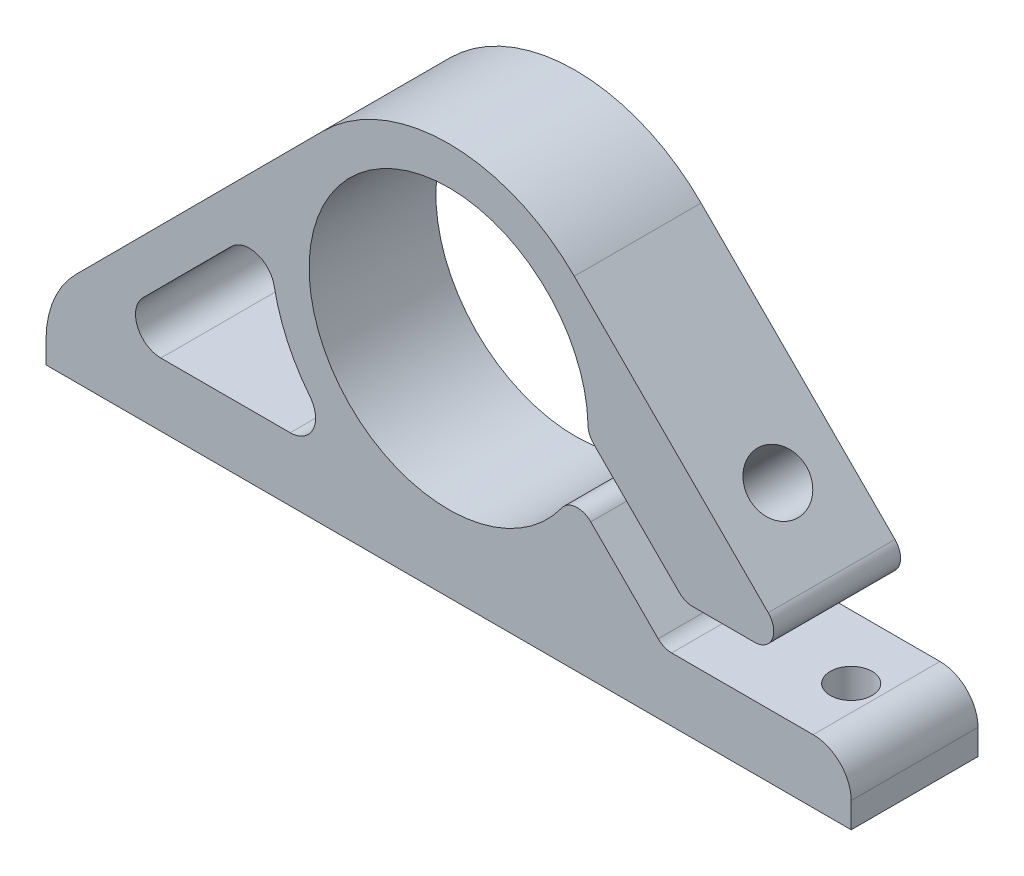
ISO-10303-21;
HEADER;
FILE_DESCRIPTION(('STEP AP214'),'2;1');
FILE_NAME('part.step','',(''),(''),'','','');
FILE_SCHEMA(('AUTOMOTIVE_DESIGN { 1 0 10303 214 1 1 1 1 }'));
ENDSEC;
DATA;
#1=APPLICATION_CONTEXT('core data for automotive mechanical design processes');
#2=APPLICATION_PROTOCOL_DEFINITION('international standard','automotive_design',2000,#1);
#3=PRODUCT_CONTEXT('',#1,'mechanical');
#4=PRODUCT('Part','Part','',(#3));
#5=PRODUCT_RELATED_PRODUCT_CATEGORY('part','',(#4));
#6=PRODUCT_DEFINITION_FORMATION('','',#4);
#7=PRODUCT_DEFINITION_CONTEXT('part definition',#1,'design');
#8=PRODUCT_DEFINITION('design','',#6,#7);
#9=PRODUCT_DEFINITION_SHAPE('','',#8);
#10=(LENGTH_UNIT() NAMED_UNIT(*) SI_UNIT(.MILLI.,.METRE.));
#11=(NAMED_UNIT(*) PLANE_ANGLE_UNIT() SI_UNIT($,.RADIAN.));
#12=(NAMED_UNIT(*) SI_UNIT($,.STERADIAN.) SOLID_ANGLE_UNIT());
#13=UNCERTAINTY_MEASURE_WITH_UNIT(LENGTH_MEASURE(1.E-05),#10,'distance_accuracy_value','');
#14=(GEOMETRIC_REPRESENTATION_CONTEXT(3) GLOBAL_UNCERTAINTY_ASSIGNED_CONTEXT((#13)) GLOBAL_UNIT_ASSIGNED_CONTEXT((#10,
#11,#12)) REPRESENTATION_CONTEXT('',''));
#15=CARTESIAN_POINT('',(0.,0.,0.));
#16=DIRECTION('',(0.,0.,1.));
#17=DIRECTION('',(1.,0.,0.));
#18=AXIS2_PLACEMENT_3D('',#15,#16,#17);
#19=CARTESIAN_POINT('',(0.,0.,10.));
#20=DIRECTION('',(0.,0.,1.));
#21=DIRECTION('',(1.,0.,0.));
#22=AXIS2_PLACEMENT_3D('',#19,#20,#21);
#23=PLANE('',#22);
#24=CARTESIAN_POINT('',(0.,0.,10.));
#25=DIRECTION('',(0.,0.,-1.));
#26=DIRECTION('',(1.,0.,0.));
#27=AXIS2_PLACEMENT_3D('',#24,#25,#26);
#28=CIRCLE('',#27,14.);
#29=CARTESIAN_POINT('',(-10.9287464971972,-8.75,10.));
#30=VERTEX_POINT('',#29);
#31=CARTESIAN_POINT('',(-13.7504022944796,-2.63181244391958,10.));
#32=VERTEX_POINT('',#31);
#33=EDGE_CURVE('E233',#30,#32,#28,.T.);
#34=ORIENTED_EDGE('',*,*,#33,.F.);
#35=CARTESIAN_POINT('',(-12.4899959967968,-10.,10.));
#36=DIRECTION('',(0.,0.,1.));
#37=DIRECTION('',(1.,0.,0.));
#38=AXIS2_PLACEMENT_3D('',#35,#36,#37);
#39=CIRCLE('',#38,2.);
#40=CARTESIAN_POINT('',(-12.4899959967968,-12.,10.));
#41=VERTEX_POINT('',#40);
#42=EDGE_CURVE('E396',#30,#41,#39,.F.);
#43=ORIENTED_EDGE('',*,*,#42,.T.);
#44=DIRECTION('',(1.,0.,0.));
#45=VECTOR('',#44,1.);
#46=CARTESIAN_POINT('',(-22.6913140604261,-12.,10.));
#47=LINE('',#46,#45);
#48=CARTESIAN_POINT('',(-22.6913140604261,-12.,10.));
#49=VERTEX_POINT('',#48);
#50=EDGE_CURVE('E239',#49,#41,#47,.T.);
#51=ORIENTED_EDGE('',*,*,#50,.F.);
#52=CARTESIAN_POINT('',(-22.6913140604261,-10.,10.));
#53=DIRECTION('',(0.,0.,1.));
#54=DIRECTION('',(1.,0.,0.));
#55=AXIS2_PLACEMENT_3D('',#52,#53,#54);
#56=CIRCLE('',#55,2.);
#57=CARTESIAN_POINT('',(-24.1071107280171,-8.58737131699868,10.));
#58=VERTEX_POINT('',#57);
#59=EDGE_CURVE('E210',#58,#49,#56,.T.);
#60=ORIENTED_EDGE('',*,*,#59,.F.);
#61=DIRECTION('',(-0.706314341500663,-0.707898333795528,0.));
#62=VECTOR('',#61,1.);
#63=CARTESIAN_POINT('',(-13.9037432997193,1.63887835287128,10.));
#64=LINE('',#63,#62);
#65=CARTESIAN_POINT('',(-17.1305421469963,-1.59515696719248,10.));
#66=VERTEX_POINT('',#65);
#67=EDGE_CURVE('E236',#66,#58,#64,.T.);
#68=ORIENTED_EDGE('',*,*,#67,.F.);
#69=CARTESIAN_POINT('',(-15.7147454794053,-3.00778565019381,10.));
#70=DIRECTION('',(0.,0.,1.));
#71=DIRECTION('',(1.,0.,0.));
#72=AXIS2_PLACEMENT_3D('',#69,#70,#71);
#73=CIRCLE('',#72,2.);
#74=EDGE_CURVE('E400',#66,#32,#73,.F.);
#75=ORIENTED_EDGE('',*,*,#74,.T.);
#76=EDGE_LOOP('',(#34,#43,#51,#60,#68,#75));
#77=FACE_BOUND('',#76,.T.);
#78=DIRECTION('',(-0.706314341500663,-0.707898333795528,0.));
#79=VECTOR('',#78,1.);
#80=CARTESIAN_POINT('',(-31.7499999999999,-12.,10.));
#81=LINE('',#80,#79);
#82=CARTESIAN_POINT('',(-9.9105766731374,9.88840078100929,10.));
#83=VERTEX_POINT('',#82);
#84=CARTESIAN_POINT('',(-29.4131866703642,-9.65794609390811,10.));
#85=VERTEX_POINT('',#84);
#86=EDGE_CURVE('E304',#83,#85,#81,.T.);
#87=ORIENTED_EDGE('',*,*,#86,.T.);
#88=CARTESIAN_POINT('',(-23.7499999999999,-15.3084608259134,10.));
#89=DIRECTION('',(0.,0.,1.));
#90=DIRECTION('',(1.,0.,0.));
#91=AXIS2_PLACEMENT_3D('',#88,#89,#90);
#92=CIRCLE('',#91,8.);
#93=CARTESIAN_POINT('',(-31.7499999999999,-15.3084608259134,10.));
#94=VERTEX_POINT('',#93);
#95=EDGE_CURVE('E11',#85,#94,#92,.T.);
#96=ORIENTED_EDGE('',*,*,#95,.T.);
#97=DIRECTION('',(0.,-1.,0.));
#98=VECTOR('',#97,1.);
#99=CARTESIAN_POINT('',(-31.7499999999999,-12.,10.));
#100=LINE('',#99,#98);
#101=CARTESIAN_POINT('',(-31.7499999999999,-17.,10.));
#102=VERTEX_POINT('',#101);
#103=EDGE_CURVE('E306',#94,#102,#100,.T.);
#104=ORIENTED_EDGE('',*,*,#103,.T.);
#105=DIRECTION('',(1.,0.,0.));
#106=VECTOR('',#105,1.);
#107=CARTESIAN_POINT('',(-31.7499999999999,-17.,10.));
#108=LINE('',#107,#106);
#109=CARTESIAN_POINT('',(31.7500000000001,-17.,10.));
#110=VERTEX_POINT('',#109);
#111=EDGE_CURVE('E308',#102,#110,#108,.T.);
#112=ORIENTED_EDGE('',*,*,#111,.T.);
#113=DIRECTION('',(0.,1.,0.));
#114=VECTOR('',#113,1.);
#115=CARTESIAN_POINT('',(31.7500000000001,-12.,10.));
#116=LINE('',#115,#114);
#117=CARTESIAN_POINT('',(31.7500000000001,-15.,10.));
#118=VERTEX_POINT('',#117);
#119=EDGE_CURVE('E296',#110,#118,#116,.T.);
#120=ORIENTED_EDGE('',*,*,#119,.T.);
#121=CARTESIAN_POINT('',(28.7500000000001,-15.,10.));
#122=DIRECTION('',(0.,0.,1.));
#123=DIRECTION('',(1.,0.,0.));
#124=AXIS2_PLACEMENT_3D('',#121,#122,#123);
#125=CIRCLE('',#124,3.);
#126=CARTESIAN_POINT('',(28.7500000000001,-12.,10.));
#127=VERTEX_POINT('',#126);
#128=EDGE_CURVE('E385',#118,#127,#125,.T.);
#129=ORIENTED_EDGE('',*,*,#128,.T.);
#130=DIRECTION('',(1.,0.,0.));
#131=VECTOR('',#130,1.);
#132=CARTESIAN_POINT('',(31.7500000000001,-12.,10.));
#133=LINE('',#132,#131);
#134=CARTESIAN_POINT('',(17.5868200661706,-12.,10.));
#135=VERTEX_POINT('',#134);
#136=EDGE_CURVE('E282',#135,#127,#133,.T.);
#137=ORIENTED_EDGE('',*,*,#136,.F.);
#138=CARTESIAN_POINT('',(17.5868200661706,-10.5,10.));
#139=DIRECTION('',(0.,0.,1.));
#140=DIRECTION('',(1.,0.,0.));
#141=AXIS2_PLACEMENT_3D('',#138,#139,#140);
#142=CIRCLE('',#141,1.5);
#143=CARTESIAN_POINT('',(16.5249725654773,-11.559471512251,10.));
#144=VERTEX_POINT('',#143);
#145=EDGE_CURVE('E374',#135,#144,#142,.F.);
#146=ORIENTED_EDGE('',*,*,#145,.T.);
#147=DIRECTION('',(0.706314341500665,-0.707898333795526,0.));
#148=VECTOR('',#147,1.);
#149=CARTESIAN_POINT('',(9.85899564609831,-4.87854536211508,10.));
#150=LINE('',#149,#148);
#151=CARTESIAN_POINT('',(11.2126058764745,-6.23519122131712,10.));
#152=VERTEX_POINT('',#151);
#153=EDGE_CURVE('E265',#152,#144,#150,.T.);
#154=ORIENTED_EDGE('',*,*,#153,.F.);
#155=CARTESIAN_POINT('',(10.1507583757812,-7.29466273356811,10.));
#156=DIRECTION('',(0.,0.,1.));
#157=DIRECTION('',(1.,0.,0.));
#158=AXIS2_PLACEMENT_3D('',#155,#156,#157);
#159=CIRCLE('',#158,1.5);
#160=CARTESIAN_POINT('',(8.93266737068747,-6.41930320553994,10.));
#161=VERTEX_POINT('',#160);
#162=EDGE_CURVE('E342',#152,#161,#159,.T.);
#163=ORIENTED_EDGE('',*,*,#162,.T.);
#164=CARTESIAN_POINT('',(0.,0.,10.));
#165=DIRECTION('',(0.,0.,1.));
#166=DIRECTION('',(1.,0.,0.));
#167=AXIS2_PLACEMENT_3D('',#164,#165,#166);
#168=CIRCLE('',#167,11.);
#169=CARTESIAN_POINT('',(10.9975421875151,0.232520609461726,10.));
#170=VERTEX_POINT('',#169);
#171=EDGE_CURVE('E290',#170,#161,#168,.T.);
#172=ORIENTED_EDGE('',*,*,#171,.F.);
#173=CARTESIAN_POINT('',(12.4972070312672,0.264227965297416,10.));
#174=DIRECTION('',(0.,0.,1.));
#175=DIRECTION('',(1.,0.,0.));
#176=AXIS2_PLACEMENT_3D('',#173,#174,#175);
#177=CIRCLE('',#176,1.5);
#178=CARTESIAN_POINT('',(11.4353595305739,-0.79524354695358,10.));
#179=VERTEX_POINT('',#178);
#180=EDGE_CURVE('E344',#170,#179,#177,.T.);
#181=ORIENTED_EDGE('',*,*,#180,.T.);
#182=DIRECTION('',(-0.706314341500665,0.707898333795526,0.));
#183=VECTOR('',#182,1.);
#184=CARTESIAN_POINT('',(10.9943273556234,-0.353222305908989,10.));
#185=LINE('',#184,#183);
#186=CARTESIAN_POINT('',(18.1844518690925,-7.559471512251,10.));
#187=VERTEX_POINT('',#186);
#188=EDGE_CURVE('E270',#187,#179,#185,.T.);
#189=ORIENTED_EDGE('',*,*,#188,.F.);
#190=CARTESIAN_POINT('',(19.2462993697858,-6.5,10.));
#191=DIRECTION('',(0.,0.,1.));
#192=DIRECTION('',(1.,0.,0.));
#193=AXIS2_PLACEMENT_3D('',#190,#191,#192);
#194=CIRCLE('',#193,1.5);
#195=CARTESIAN_POINT('',(19.2462993697858,-8.,10.));
#196=VERTEX_POINT('',#195);
#197=EDGE_CURVE('E338',#187,#196,#194,.T.);
#198=ORIENTED_EDGE('',*,*,#197,.T.);
#199=DIRECTION('',(-1.,0.,0.));
#200=VECTOR('',#199,1.);
#201=CARTESIAN_POINT('',(31.7500000000001,-8.,10.));
#202=LINE('',#201,#200);
#203=CARTESIAN_POINT('',(24.1433584510894,-8.,10.));
#204=VERTEX_POINT('',#203);
#205=EDGE_CURVE('E285',#204,#196,#202,.T.);
#206=ORIENTED_EDGE('',*,*,#205,.F.);
#207=CARTESIAN_POINT('',(24.1433584510894,-6.5,10.));
#208=DIRECTION('',(0.,0.,1.));
#209=DIRECTION('',(1.,0.,0.));
#210=AXIS2_PLACEMENT_3D('',#207,#208,#209);
#211=CIRCLE('',#210,1.5);
#212=CARTESIAN_POINT('',(25.2052059517827,-5.440528487749,10.));
#213=VERTEX_POINT('',#212);
#214=EDGE_CURVE('E340',#204,#213,#211,.T.);
#215=ORIENTED_EDGE('',*,*,#214,.T.);
#216=DIRECTION('',(-0.706314341500666,0.707898333795526,0.));
#217=VECTOR('',#216,1.);
#218=CARTESIAN_POINT('',(31.7500000000001,-12.,10.));
#219=LINE('',#218,#217);
#220=CARTESIAN_POINT('',(9.91057667313737,9.88840078100932,10.));
#221=VERTEX_POINT('',#220);
#222=EDGE_CURVE('E299',#213,#221,#219,.T.);
#223=ORIENTED_EDGE('',*,*,#222,.T.);
#224=CARTESIAN_POINT('',(0.,0.,10.));
#225=DIRECTION('',(0.,0.,1.));
#226=DIRECTION('',(1.,0.,0.));
#227=AXIS2_PLACEMENT_3D('',#224,#225,#226);
#228=CIRCLE('',#227,14.);
#229=EDGE_CURVE('E302',#221,#83,#228,.T.);
#230=ORIENTED_EDGE('',*,*,#229,.T.);
#231=EDGE_LOOP('',(#87,#96,#104,#112,#120,#129,#137,#146,#154,#163,#172,#181,#189,#198,#206,
#215,#223,#230));
#232=FACE_BOUND('',#231,.T.);
#233=ADVANCED_FACE('F38',(#77,#232),#23,.T.);
#234=CARTESIAN_POINT('',(0.,0.,0.));
#235=DIRECTION('',(0.,0.,1.));
#236=DIRECTION('',(1.,0.,0.));
#237=AXIS2_PLACEMENT_3D('',#234,#235,#236);
#238=PLANE('',#237);
#239=DIRECTION('',(1.,0.,0.));
#240=VECTOR('',#239,1.);
#241=CARTESIAN_POINT('',(-22.6913140604261,-12.,0.));
#242=LINE('',#241,#240);
#243=CARTESIAN_POINT('',(-22.6913140604261,-12.,0.));
#244=VERTEX_POINT('',#243);
#245=CARTESIAN_POINT('',(-12.4899959967968,-12.,0.));
#246=VERTEX_POINT('',#245);
#247=EDGE_CURVE('E218',#244,#246,#242,.T.);
#248=ORIENTED_EDGE('',*,*,#247,.T.);
#249=CARTESIAN_POINT('',(-12.4899959967968,-10.,0.));
#250=DIRECTION('',(0.,0.,1.));
#251=DIRECTION('',(1.,0.,0.));
#252=AXIS2_PLACEMENT_3D('',#249,#250,#251);
#253=CIRCLE('',#252,2.);
#254=CARTESIAN_POINT('',(-10.9287464971972,-8.75,0.));
#255=VERTEX_POINT('',#254);
#256=EDGE_CURVE('E398',#246,#255,#253,.T.);
#257=ORIENTED_EDGE('',*,*,#256,.T.);
#258=CARTESIAN_POINT('',(0.,0.,0.));
#259=DIRECTION('',(0.,0.,-1.));
#260=DIRECTION('',(1.,0.,0.));
#261=AXIS2_PLACEMENT_3D('',#258,#259,#260);
#262=CIRCLE('',#261,14.);
#263=CARTESIAN_POINT('',(-13.7504022944796,-2.63181244391958,0.));
#264=VERTEX_POINT('',#263);
#265=EDGE_CURVE('E229',#255,#264,#262,.T.);
#266=ORIENTED_EDGE('',*,*,#265,.T.);
#267=CARTESIAN_POINT('',(-15.7147454794053,-3.00778565019381,0.));
#268=DIRECTION('',(0.,0.,1.));
#269=DIRECTION('',(1.,0.,0.));
#270=AXIS2_PLACEMENT_3D('',#267,#268,#269);
#271=CIRCLE('',#270,2.);
#272=CARTESIAN_POINT('',(-17.1305421469963,-1.59515696719248,0.));
#273=VERTEX_POINT('',#272);
#274=EDGE_CURVE('E402',#264,#273,#271,.T.);
#275=ORIENTED_EDGE('',*,*,#274,.T.);
#276=DIRECTION('',(-0.706314341500663,-0.707898333795528,0.));
#277=VECTOR('',#276,1.);
#278=CARTESIAN_POINT('',(-13.9037432997193,1.63887835287128,0.));
#279=LINE('',#278,#277);
#280=CARTESIAN_POINT('',(-24.1071107280171,-8.58737131699867,0.));
#281=VERTEX_POINT('',#280);
#282=EDGE_CURVE('E227',#273,#281,#279,.T.);
#283=ORIENTED_EDGE('',*,*,#282,.T.);
#284=CARTESIAN_POINT('',(-22.6913140604261,-10.,0.));
#285=DIRECTION('',(0.,0.,1.));
#286=DIRECTION('',(1.,0.,0.));
#287=AXIS2_PLACEMENT_3D('',#284,#285,#286);
#288=CIRCLE('',#287,2.);
#289=EDGE_CURVE('E207',#281,#244,#288,.T.);
#290=ORIENTED_EDGE('',*,*,#289,.T.);
#291=EDGE_LOOP('',(#248,#257,#266,#275,#283,#290));
#292=FACE_BOUND('',#291,.T.);
#293=DIRECTION('',(0.,-1.,0.));
#294=VECTOR('',#293,1.);
#295=CARTESIAN_POINT('',(-31.7499999999999,-12.,0.));
#296=LINE('',#295,#294);
#297=CARTESIAN_POINT('',(-31.7499999999999,-15.3084608259134,0.));
#298=VERTEX_POINT('',#297);
#299=CARTESIAN_POINT('',(-31.7499999999999,-17.,0.));
#300=VERTEX_POINT('',#299);
#301=EDGE_CURVE('E319',#298,#300,#296,.T.);
#302=ORIENTED_EDGE('',*,*,#301,.F.);
#303=CARTESIAN_POINT('',(-23.7499999999999,-15.3084608259134,0.));
#304=DIRECTION('',(0.,0.,1.));
#305=DIRECTION('',(1.,0.,0.));
#306=AXIS2_PLACEMENT_3D('',#303,#304,#305);
#307=CIRCLE('',#306,8.);
#308=CARTESIAN_POINT('',(-29.4131866703642,-9.65794609390811,0.));
#309=VERTEX_POINT('',#308);
#310=EDGE_CURVE('E60',#298,#309,#307,.F.);
#311=ORIENTED_EDGE('',*,*,#310,.T.);
#312=DIRECTION('',(-0.706314341500663,-0.707898333795528,0.));
#313=VECTOR('',#312,1.);
#314=CARTESIAN_POINT('',(-31.7499999999999,-12.,0.));
#315=LINE('',#314,#313);
#316=CARTESIAN_POINT('',(-9.9105766731374,9.88840078100929,0.));
#317=VERTEX_POINT('',#316);
#318=EDGE_CURVE('E317',#317,#309,#315,.T.);
#319=ORIENTED_EDGE('',*,*,#318,.F.);
#320=CARTESIAN_POINT('',(0.,0.,0.));
#321=DIRECTION('',(0.,0.,1.));
#322=DIRECTION('',(1.,0.,0.));
#323=AXIS2_PLACEMENT_3D('',#320,#321,#322);
#324=CIRCLE('',#323,14.);
#325=CARTESIAN_POINT('',(9.91057667313737,9.88840078100932,0.));
#326=VERTEX_POINT('',#325);
#327=EDGE_CURVE('E315',#326,#317,#324,.T.);
#328=ORIENTED_EDGE('',*,*,#327,.F.);
#329=DIRECTION('',(-0.706314341500666,0.707898333795526,0.));
#330=VECTOR('',#329,1.);
#331=CARTESIAN_POINT('',(31.7500000000001,-12.,0.));
#332=LINE('',#331,#330);
#333=CARTESIAN_POINT('',(25.2052059517827,-5.440528487749,0.));
#334=VERTEX_POINT('',#333);
#335=EDGE_CURVE('E313',#334,#326,#332,.T.);
#336=ORIENTED_EDGE('',*,*,#335,.F.);
#337=CARTESIAN_POINT('',(24.1433584510894,-6.5,0.));
#338=DIRECTION('',(0.,0.,1.));
#339=DIRECTION('',(1.,0.,0.));
#340=AXIS2_PLACEMENT_3D('',#337,#338,#339);
#341=CIRCLE('',#340,1.5);
#342=CARTESIAN_POINT('',(24.1433584510894,-8.,0.));
#343=VERTEX_POINT('',#342);
#344=EDGE_CURVE('E353',#334,#343,#341,.F.);
#345=ORIENTED_EDGE('',*,*,#344,.T.);
#346=DIRECTION('',(-1.,0.,0.));
#347=VECTOR('',#346,1.);
#348=CARTESIAN_POINT('',(31.7500000000001,-8.,0.));
#349=LINE('',#348,#347);
#350=CARTESIAN_POINT('',(19.2462993697858,-8.,0.));
#351=VERTEX_POINT('',#350);
#352=EDGE_CURVE('E273',#343,#351,#349,.T.);
#353=ORIENTED_EDGE('',*,*,#352,.T.);
#354=CARTESIAN_POINT('',(19.2462993697858,-6.5,0.));
#355=DIRECTION('',(0.,0.,1.));
#356=DIRECTION('',(1.,0.,0.));
#357=AXIS2_PLACEMENT_3D('',#354,#355,#356);
#358=CIRCLE('',#357,1.5);
#359=CARTESIAN_POINT('',(18.1844518690925,-7.559471512251,0.));
#360=VERTEX_POINT('',#359);
#361=EDGE_CURVE('E351',#351,#360,#358,.F.);
#362=ORIENTED_EDGE('',*,*,#361,.T.);
#363=DIRECTION('',(-0.706314341500665,0.707898333795526,0.));
#364=VECTOR('',#363,1.);
#365=CARTESIAN_POINT('',(10.9943273556234,-0.353222305908989,0.));
#366=LINE('',#365,#364);
#367=CARTESIAN_POINT('',(11.4353595305739,-0.79524354695358,0.));
#368=VERTEX_POINT('',#367);
#369=EDGE_CURVE('E276',#360,#368,#366,.T.);
#370=ORIENTED_EDGE('',*,*,#369,.T.);
#371=CARTESIAN_POINT('',(12.4972070312672,0.264227965297416,0.));
#372=DIRECTION('',(0.,0.,1.));
#373=DIRECTION('',(1.,0.,0.));
#374=AXIS2_PLACEMENT_3D('',#371,#372,#373);
#375=CIRCLE('',#374,1.5);
#376=CARTESIAN_POINT('',(10.9975421875151,0.232520609461726,0.));
#377=VERTEX_POINT('',#376);
#378=EDGE_CURVE('E357',#368,#377,#375,.F.);
#379=ORIENTED_EDGE('',*,*,#378,.T.);
#380=CARTESIAN_POINT('',(0.,0.,0.));
#381=DIRECTION('',(0.,0.,1.));
#382=DIRECTION('',(1.,0.,0.));
#383=AXIS2_PLACEMENT_3D('',#380,#381,#382);
#384=CIRCLE('',#383,11.);
#385=CARTESIAN_POINT('',(8.93266737068747,-6.41930320553994,0.));
#386=VERTEX_POINT('',#385);
#387=EDGE_CURVE('E279',#377,#386,#384,.T.);
#388=ORIENTED_EDGE('',*,*,#387,.T.);
#389=CARTESIAN_POINT('',(10.1507583757812,-7.29466273356811,0.));
#390=DIRECTION('',(0.,0.,1.));
#391=DIRECTION('',(1.,0.,0.));
#392=AXIS2_PLACEMENT_3D('',#389,#390,#391);
#393=CIRCLE('',#392,1.5);
#394=CARTESIAN_POINT('',(11.2126058764745,-6.23519122131712,0.));
#395=VERTEX_POINT('',#394);
#396=EDGE_CURVE('E355',#386,#395,#393,.F.);
#397=ORIENTED_EDGE('',*,*,#396,.T.);
#398=DIRECTION('',(0.706314341500665,-0.707898333795526,0.));
#399=VECTOR('',#398,1.);
#400=CARTESIAN_POINT('',(9.85899564609831,-4.87854536211508,0.));
#401=LINE('',#400,#399);
#402=CARTESIAN_POINT('',(16.5249725654773,-11.559471512251,0.));
#403=VERTEX_POINT('',#402);
#404=EDGE_CURVE('E266',#395,#403,#401,.T.);
#405=ORIENTED_EDGE('',*,*,#404,.T.);
#406=CARTESIAN_POINT('',(17.5868200661706,-10.5,0.));
#407=DIRECTION('',(0.,0.,1.));
#408=DIRECTION('',(1.,0.,0.));
#409=AXIS2_PLACEMENT_3D('',#406,#407,#408);
#410=CIRCLE('',#409,1.5);
#411=CARTESIAN_POINT('',(17.5868200661706,-12.,0.));
#412=VERTEX_POINT('',#411);
#413=EDGE_CURVE('E376',#403,#412,#410,.T.);
#414=ORIENTED_EDGE('',*,*,#413,.T.);
#415=DIRECTION('',(1.,0.,0.));
#416=VECTOR('',#415,1.);
#417=CARTESIAN_POINT('',(31.7500000000001,-12.,0.));
#418=LINE('',#417,#416);
#419=CARTESIAN_POINT('',(28.7500000000001,-12.,0.));
#420=VERTEX_POINT('',#419);
#421=EDGE_CURVE('E269',#412,#420,#418,.T.);
#422=ORIENTED_EDGE('',*,*,#421,.T.);
#423=CARTESIAN_POINT('',(28.7500000000001,-15.,0.));
#424=DIRECTION('',(0.,0.,1.));
#425=DIRECTION('',(1.,0.,0.));
#426=AXIS2_PLACEMENT_3D('',#423,#424,#425);
#427=CIRCLE('',#426,3.);
#428=CARTESIAN_POINT('',(31.7500000000001,-15.,0.));
#429=VERTEX_POINT('',#428);
#430=EDGE_CURVE('E381',#420,#429,#427,.F.);
#431=ORIENTED_EDGE('',*,*,#430,.T.);
#432=DIRECTION('',(0.,1.,0.));
#433=VECTOR('',#432,1.);
#434=CARTESIAN_POINT('',(31.7500000000001,-12.,0.));
#435=LINE('',#434,#433);
#436=CARTESIAN_POINT('',(31.7500000000001,-17.,0.));
#437=VERTEX_POINT('',#436);
#438=EDGE_CURVE('E293',#437,#429,#435,.T.);
#439=ORIENTED_EDGE('',*,*,#438,.F.);
#440=DIRECTION('',(1.,0.,0.));
#441=VECTOR('',#440,1.);
#442=CARTESIAN_POINT('',(-31.7499999999999,-17.,0.));
#443=LINE('',#442,#441);
#444=EDGE_CURVE('E300',#300,#437,#443,.T.);
#445=ORIENTED_EDGE('',*,*,#444,.F.);
#446=EDGE_LOOP('',(#302,#311,#319,#328,#336,#345,#353,#362,#370,#379,#388,#397,#405,#414,#422,
#431,#439,#445));
#447=FACE_BOUND('',#446,.T.);
#448=ADVANCED_FACE('F225',(#292,#447),#238,.F.);
#449=CARTESIAN_POINT('',(31.7500000000001,-12.,10.));
#450=DIRECTION('',(-1.,0.,0.));
#451=DIRECTION('',(0.,0.,1.));
#452=AXIS2_PLACEMENT_3D('',#449,#450,#451);
#453=PLANE('',#452);
#454=ORIENTED_EDGE('',*,*,#438,.T.);
#455=DIRECTION('',(0.,0.,-1.));
#456=VECTOR('',#455,1.);
#457=CARTESIAN_POINT('',(31.7500000000001,-15.,10.));
#458=LINE('',#457,#456);
#459=EDGE_CURVE('E383',#429,#118,#458,.F.);
#460=ORIENTED_EDGE('',*,*,#459,.T.);
#461=ORIENTED_EDGE('',*,*,#119,.F.);
#462=DIRECTION('',(0.,0.,-1.));
#463=VECTOR('',#462,1.);
#464=CARTESIAN_POINT('',(31.7500000000001,-17.,10.));
#465=LINE('',#464,#463);
#466=EDGE_CURVE('E310',#110,#437,#465,.T.);
#467=ORIENTED_EDGE('',*,*,#466,.T.);
#468=EDGE_LOOP('',(#454,#460,#461,#467));
#469=FACE_BOUND('',#468,.T.);
#470=ADVANCED_FACE('F422',(#469),#453,.F.);
#471=CARTESIAN_POINT('',(31.7500000000001,-12.,10.));
#472=DIRECTION('',(-0.707898333795526,-0.706314341500666,0.));
#473=DIRECTION('',(0.706314341500666,-0.707898333795526,0.));
#474=AXIS2_PLACEMENT_3D('',#471,#472,#473);
#475=PLANE('',#474);
#476=CARTESIAN_POINT('',(20.9673199027787,-1.19313848497585,5.));
#477=DIRECTION('',(0.707898333795525,0.706314341500666,0.));
#478=DIRECTION('',(-0.706314341500666,0.707898333795525,0.));
#479=AXIS2_PLACEMENT_3D('',#476,#477,#478);
#480=CIRCLE('',#479,2.24999999999999);
#481=CARTESIAN_POINT('',(19.3781126344022,0.399632766064077,5.));
#482=VERTEX_POINT('',#481);
#483=EDGE_CURVE('E247',#482,#482,#480,.T.);
#484=ORIENTED_EDGE('',*,*,#483,.F.);
#485=EDGE_LOOP('',(#484));
#486=FACE_BOUND('',#485,.T.);
#487=ORIENTED_EDGE('',*,*,#222,.F.);
#488=DIRECTION('',(0.,0.,-1.));
#489=VECTOR('',#488,1.);
#490=CARTESIAN_POINT('',(25.2052059517827,-5.440528487749,10.));
#491=LINE('',#490,#489);
#492=EDGE_CURVE('E364',#213,#334,#491,.T.);
#493=ORIENTED_EDGE('',*,*,#492,.T.);
#494=ORIENTED_EDGE('',*,*,#335,.T.);
#495=DIRECTION('',(0.,0.,-1.));
#496=VECTOR('',#495,1.);
#497=CARTESIAN_POINT('',(9.91057667313737,9.88840078100932,10.));
#498=LINE('',#497,#496);
#499=EDGE_CURVE('E330',#221,#326,#498,.T.);
#500=ORIENTED_EDGE('',*,*,#499,.F.);
#501=EDGE_LOOP('',(#487,#493,#494,#500));
#502=FACE_BOUND('',#501,.T.);
#503=ADVANCED_FACE('F477',(#486,#502),#475,.F.);
#504=CARTESIAN_POINT('',(0.,0.,10.));
#505=DIRECTION('',(0.,0.,-1.));
#506=DIRECTION('',(-1.,0.,0.));
#507=AXIS2_PLACEMENT_3D('',#504,#505,#506);
#508=CYLINDRICAL_SURFACE('',#507,14.);
#509=ORIENTED_EDGE('',*,*,#327,.T.);
#510=DIRECTION('',(0.,0.,-1.));
#511=VECTOR('',#510,1.);
#512=CARTESIAN_POINT('',(-9.9105766731374,9.88840078100929,10.));
#513=LINE('',#512,#511);
#514=EDGE_CURVE('E327',#83,#317,#513,.T.);
#515=ORIENTED_EDGE('',*,*,#514,.F.);
#516=ORIENTED_EDGE('',*,*,#229,.F.);
#517=ORIENTED_EDGE('',*,*,#499,.T.);
#518=EDGE_LOOP('',(#509,#515,#516,#517));
#519=FACE_BOUND('',#518,.T.);
#520=ADVANCED_FACE('F483',(#519),#508,.T.);
#521=CARTESIAN_POINT('',(-31.7499999999999,-12.,10.));
#522=DIRECTION('',(0.707898333795528,-0.706314341500663,0.));
#523=DIRECTION('',(0.706314341500663,0.707898333795528,0.));
#524=AXIS2_PLACEMENT_3D('',#521,#522,#523);
#525=PLANE('',#524);
#526=ORIENTED_EDGE('',*,*,#318,.T.);
#527=DIRECTION('',(0.,0.,-1.));
#528=VECTOR('',#527,1.);
#529=CARTESIAN_POINT('',(-29.4131866703642,-9.65794609390811,10.));
#530=LINE('',#529,#528);
#531=EDGE_CURVE('E46',#309,#85,#530,.F.);
#532=ORIENTED_EDGE('',*,*,#531,.T.);
#533=ORIENTED_EDGE('',*,*,#86,.F.);
#534=ORIENTED_EDGE('',*,*,#514,.T.);
#535=EDGE_LOOP('',(#526,#532,#533,#534));
#536=FACE_BOUND('',#535,.T.);
#537=ADVANCED_FACE('F507',(#536),#525,.F.);
#538=CARTESIAN_POINT('',(-31.7499999999999,-12.,10.));
#539=DIRECTION('',(1.,0.,0.));
#540=DIRECTION('',(0.,0.,-1.));
#541=AXIS2_PLACEMENT_3D('',#538,#539,#540);
#542=PLANE('',#541);
#543=ORIENTED_EDGE('',*,*,#103,.F.);
#544=DIRECTION('',(0.,0.,-1.));
#545=VECTOR('',#544,1.);
#546=CARTESIAN_POINT('',(-31.7499999999999,-15.3084608259134,10.));
#547=LINE('',#546,#545);
#548=EDGE_CURVE('E404',#94,#298,#547,.T.);
#549=ORIENTED_EDGE('',*,*,#548,.T.);
#550=ORIENTED_EDGE('',*,*,#301,.T.);
#551=DIRECTION('',(0.,0.,-1.));
#552=VECTOR('',#551,1.);
#553=CARTESIAN_POINT('',(-31.7499999999999,-17.,10.));
#554=LINE('',#553,#552);
#555=EDGE_CURVE('E324',#102,#300,#554,.T.);
#556=ORIENTED_EDGE('',*,*,#555,.F.);
#557=EDGE_LOOP('',(#543,#549,#550,#556));
#558=FACE_BOUND('',#557,.T.);
#559=ADVANCED_FACE('F410',(#558),#542,.F.);
#560=CARTESIAN_POINT('',(-31.7499999999999,-17.,10.));
#561=DIRECTION('',(0.,1.,0.));
#562=DIRECTION('',(0.,0.,1.));
#563=AXIS2_PLACEMENT_3D('',#560,#561,#562);
#564=PLANE('',#563);
#565=CARTESIAN_POINT('',(5.12500965710509,-17.,5.));
#566=DIRECTION('',(0.,1.,0.));
#567=DIRECTION('',(1.,0.,0.));
#568=AXIS2_PLACEMENT_3D('',#565,#566,#567);
#569=ELLIPSE('',#568,2.33607036279956,1.64999999999999);
#570=CARTESIAN_POINT('',(7.46108001990465,-17.,5.));
#571=VERTEX_POINT('',#570);
#572=EDGE_CURVE('E244',#571,#571,#569,.T.);
#573=ORIENTED_EDGE('',*,*,#572,.T.);
#574=EDGE_LOOP('',(#573));
#575=FACE_BOUND('',#574,.T.);
#576=CARTESIAN_POINT('',(-26.7499999999999,-17.,5.));
#577=DIRECTION('',(0.,-1.,0.));
#578=DIRECTION('',(0.,0.,-1.));
#579=AXIS2_PLACEMENT_3D('',#576,#577,#578);
#580=CIRCLE('',#579,1.64999999999999);
#581=CARTESIAN_POINT('',(-26.7499999999999,-17.,3.35000000000001));
#582=VERTEX_POINT('',#581);
#583=EDGE_CURVE('E253',#582,#582,#580,.T.);
#584=ORIENTED_EDGE('',*,*,#583,.F.);
#585=EDGE_LOOP('',(#584));
#586=FACE_BOUND('',#585,.T.);
#587=CARTESIAN_POINT('',(26.7500000000001,-17.,5.));
#588=DIRECTION('',(0.,-1.,0.));
#589=DIRECTION('',(0.,0.,-1.));
#590=AXIS2_PLACEMENT_3D('',#587,#588,#589);
#591=CIRCLE('',#590,1.64999999999999);
#592=CARTESIAN_POINT('',(26.7500000000001,-17.,3.35000000000001));
#593=VERTEX_POINT('',#592);
#594=EDGE_CURVE('E259',#593,#593,#591,.T.);
#595=ORIENTED_EDGE('',*,*,#594,.F.);
#596=EDGE_LOOP('',(#595));
#597=FACE_BOUND('',#596,.T.);
#598=ORIENTED_EDGE('',*,*,#444,.T.);
#599=ORIENTED_EDGE('',*,*,#466,.F.);
#600=ORIENTED_EDGE('',*,*,#111,.F.);
#601=ORIENTED_EDGE('',*,*,#555,.T.);
#602=EDGE_LOOP('',(#598,#599,#600,#601));
#603=FACE_BOUND('',#602,.T.);
#604=ADVANCED_FACE('F418',(#575,#586,#597,#603),#564,.F.);
#605=CARTESIAN_POINT('',(0.,0.,10.));
#606=DIRECTION('',(0.,0.,-1.));
#607=DIRECTION('',(-1.,0.,0.));
#608=AXIS2_PLACEMENT_3D('',#605,#606,#607);
#609=CYLINDRICAL_SURFACE('',#608,11.);
#610=ORIENTED_EDGE('',*,*,#387,.F.);
#611=DIRECTION('',(0.,0.,-1.));
#612=VECTOR('',#611,1.);
#613=CARTESIAN_POINT('',(10.9975421875152,0.232520609461726,10.));
#614=LINE('',#613,#612);
#615=EDGE_CURVE('E335',#377,#170,#614,.F.);
#616=ORIENTED_EDGE('',*,*,#615,.T.);
#617=ORIENTED_EDGE('',*,*,#171,.T.);
#618=DIRECTION('',(0.,0.,-1.));
#619=VECTOR('',#618,1.);
#620=CARTESIAN_POINT('',(8.93266737068747,-6.41930320553994,10.));
#621=LINE('',#620,#619);
#622=EDGE_CURVE('E333',#161,#386,#621,.T.);
#623=ORIENTED_EDGE('',*,*,#622,.T.);
#624=EDGE_LOOP('',(#610,#616,#617,#623));
#625=FACE_BOUND('',#624,.T.);
#626=ADVANCED_FACE('F450',(#625),#609,.F.);
#627=CARTESIAN_POINT('',(9.85899564609831,-4.87854536211508,0.));
#628=DIRECTION('',(-0.707898333795526,-0.706314341500665,0.));
#629=DIRECTION('',(0.706314341500665,-0.707898333795526,0.));
#630=AXIS2_PLACEMENT_3D('',#627,#628,#629);
#631=PLANE('',#630);
#632=CARTESIAN_POINT('',(13.5580170696838,-8.58586227269437,5.));
#633=DIRECTION('',(0.707898333795526,0.706314341500665,0.));
#634=DIRECTION('',(-0.706314341500665,0.707898333795526,0.));
#635=AXIS2_PLACEMENT_3D('',#632,#633,#634);
#636=CIRCLE('',#635,1.64999999999999);
#637=CARTESIAN_POINT('',(12.3925984062077,-7.41783002193176,5.));
#638=VERTEX_POINT('',#637);
#639=EDGE_CURVE('E214',#638,#638,#636,.T.);
#640=ORIENTED_EDGE('',*,*,#639,.F.);
#641=EDGE_LOOP('',(#640));
#642=FACE_BOUND('',#641,.T.);
#643=ORIENTED_EDGE('',*,*,#404,.F.);
#644=DIRECTION('',(0.,0.,1.));
#645=VECTOR('',#644,1.);
#646=CARTESIAN_POINT('',(11.2126058764745,-6.23519122131712,10.));
#647=LINE('',#646,#645);
#648=EDGE_CURVE('E361',#395,#152,#647,.T.);
#649=ORIENTED_EDGE('',*,*,#648,.T.);
#650=ORIENTED_EDGE('',*,*,#153,.T.);
#651=DIRECTION('',(0.,0.,1.));
#652=VECTOR('',#651,1.);
#653=CARTESIAN_POINT('',(16.5249725654773,-11.559471512251,0.));
#654=LINE('',#653,#652);
#655=EDGE_CURVE('E359',#144,#403,#654,.F.);
#656=ORIENTED_EDGE('',*,*,#655,.T.);
#657=EDGE_LOOP('',(#643,#649,#650,#656));
#658=FACE_BOUND('',#657,.T.);
#659=ADVANCED_FACE('F441',(#642,#658),#631,.F.);
#660=CARTESIAN_POINT('',(31.7500000000001,-12.,0.));
#661=DIRECTION('',(0.,-1.,0.));
#662=DIRECTION('',(0.,0.,-1.));
#663=AXIS2_PLACEMENT_3D('',#660,#661,#662);
#664=PLANE('',#663);
#665=CARTESIAN_POINT('',(26.7500000000001,-12.,5.));
#666=DIRECTION('',(0.,-1.,0.));
#667=DIRECTION('',(0.,0.,-1.));
#668=AXIS2_PLACEMENT_3D('',#665,#666,#667);
#669=CIRCLE('',#668,1.65);
#670=CARTESIAN_POINT('',(26.7500000000001,-12.,3.35));
#671=VERTEX_POINT('',#670);
#672=EDGE_CURVE('E262',#671,#671,#669,.T.);
#673=ORIENTED_EDGE('',*,*,#672,.T.);
#674=EDGE_LOOP('',(#673));
#675=FACE_BOUND('',#674,.T.);
#676=ORIENTED_EDGE('',*,*,#136,.T.);
#677=DIRECTION('',(0.,0.,-1.));
#678=VECTOR('',#677,1.);
#679=CARTESIAN_POINT('',(28.7500000000001,-12.,0.));
#680=LINE('',#679,#678);
#681=EDGE_CURVE('E378',#127,#420,#680,.T.);
#682=ORIENTED_EDGE('',*,*,#681,.T.);
#683=ORIENTED_EDGE('',*,*,#421,.F.);
#684=DIRECTION('',(0.,0.,1.));
#685=VECTOR('',#684,1.);
#686=CARTESIAN_POINT('',(17.5868200661706,-12.,10.));
#687=LINE('',#686,#685);
#688=EDGE_CURVE('E371',#412,#135,#687,.T.);
#689=ORIENTED_EDGE('',*,*,#688,.T.);
#690=EDGE_LOOP('',(#676,#682,#683,#689));
#691=FACE_BOUND('',#690,.T.);
#692=ADVANCED_FACE('F432',(#675,#691),#664,.F.);
#693=CARTESIAN_POINT('',(31.7500000000001,-8.,0.));
#694=DIRECTION('',(0.,1.,0.));
#695=DIRECTION('',(0.,0.,1.));
#696=AXIS2_PLACEMENT_3D('',#693,#694,#695);
#697=PLANE('',#696);
#698=ORIENTED_EDGE('',*,*,#352,.F.);
#699=DIRECTION('',(0.,0.,-1.));
#700=VECTOR('',#699,1.);
#701=CARTESIAN_POINT('',(24.1433584510894,-8.,0.));
#702=LINE('',#701,#700);
#703=EDGE_CURVE('E369',#343,#204,#702,.F.);
#704=ORIENTED_EDGE('',*,*,#703,.T.);
#705=ORIENTED_EDGE('',*,*,#205,.T.);
#706=DIRECTION('',(0.,0.,1.));
#707=VECTOR('',#706,1.);
#708=CARTESIAN_POINT('',(19.2462993697858,-8.,0.));
#709=LINE('',#708,#707);
#710=EDGE_CURVE('E367',#196,#351,#709,.F.);
#711=ORIENTED_EDGE('',*,*,#710,.T.);
#712=EDGE_LOOP('',(#698,#704,#705,#711));
#713=FACE_BOUND('',#712,.T.);
#714=ADVANCED_FACE('F469',(#713),#697,.F.);
#715=CARTESIAN_POINT('',(10.9943273556234,-0.353222305908989,0.));
#716=DIRECTION('',(0.707898333795526,0.706314341500665,0.));
#717=DIRECTION('',(-0.706314341500665,0.707898333795526,0.));
#718=AXIS2_PLACEMENT_3D('',#715,#716,#717);
#719=PLANE('',#718);
#720=CARTESIAN_POINT('',(16.3896104048659,-5.76060490669171,5.));
#721=DIRECTION('',(0.707898333795526,0.706314341500665,0.));
#722=DIRECTION('',(-0.706314341500665,0.707898333795526,0.));
#723=AXIS2_PLACEMENT_3D('',#720,#721,#722);
#724=CIRCLE('',#723,2.24999999999999);
#725=CARTESIAN_POINT('',(14.8004031364894,-4.16783365565178,5.));
#726=VERTEX_POINT('',#725);
#727=EDGE_CURVE('E250',#726,#726,#724,.T.);
#728=ORIENTED_EDGE('',*,*,#727,.T.);
#729=EDGE_LOOP('',(#728));
#730=FACE_BOUND('',#729,.T.);
#731=ORIENTED_EDGE('',*,*,#188,.T.);
#732=DIRECTION('',(0.,0.,1.));
#733=VECTOR('',#732,1.);
#734=CARTESIAN_POINT('',(11.4353595305739,-0.795243546953581,0.));
#735=LINE('',#734,#733);
#736=EDGE_CURVE('E349',#179,#368,#735,.F.);
#737=ORIENTED_EDGE('',*,*,#736,.T.);
#738=ORIENTED_EDGE('',*,*,#369,.F.);
#739=DIRECTION('',(0.,0.,1.));
#740=VECTOR('',#739,1.);
#741=CARTESIAN_POINT('',(18.1844518690925,-7.559471512251,0.));
#742=LINE('',#741,#740);
#743=EDGE_CURVE('E346',#360,#187,#742,.T.);
#744=ORIENTED_EDGE('',*,*,#743,.T.);
#745=EDGE_LOOP('',(#731,#737,#738,#744));
#746=FACE_BOUND('',#745,.T.);
#747=ADVANCED_FACE('F458',(#730,#746),#719,.F.);
#748=CARTESIAN_POINT('',(12.4972070312672,0.264227965297416,10.));
#749=DIRECTION('',(0.,0.,-1.));
#750=DIRECTION('',(-1.,0.,0.));
#751=AXIS2_PLACEMENT_3D('',#748,#749,#750);
#752=CYLINDRICAL_SURFACE('',#751,1.5);
#753=ORIENTED_EDGE('',*,*,#378,.F.);
#754=ORIENTED_EDGE('',*,*,#736,.F.);
#755=ORIENTED_EDGE('',*,*,#180,.F.);
#756=ORIENTED_EDGE('',*,*,#615,.F.);
#757=EDGE_LOOP('',(#753,#754,#755,#756));
#758=FACE_BOUND('',#757,.T.);
#759=ADVANCED_FACE('F454',(#758),#752,.T.);
#760=CARTESIAN_POINT('',(10.1507583757812,-7.29466273356811,10.));
#761=DIRECTION('',(0.,0.,-1.));
#762=DIRECTION('',(-1.,0.,0.));
#763=AXIS2_PLACEMENT_3D('',#760,#761,#762);
#764=CYLINDRICAL_SURFACE('',#763,1.5);
#765=ORIENTED_EDGE('',*,*,#396,.F.);
#766=ORIENTED_EDGE('',*,*,#622,.F.);
#767=ORIENTED_EDGE('',*,*,#162,.F.);
#768=ORIENTED_EDGE('',*,*,#648,.F.);
#769=EDGE_LOOP('',(#765,#766,#767,#768));
#770=FACE_BOUND('',#769,.T.);
#771=ADVANCED_FACE('F445',(#770),#764,.T.);
#772=CARTESIAN_POINT('',(24.1433584510894,-6.5,10.));
#773=DIRECTION('',(0.,0.,-1.));
#774=DIRECTION('',(-1.,0.,0.));
#775=AXIS2_PLACEMENT_3D('',#772,#773,#774);
#776=CYLINDRICAL_SURFACE('',#775,1.5);
#777=ORIENTED_EDGE('',*,*,#214,.F.);
#778=ORIENTED_EDGE('',*,*,#703,.F.);
#779=ORIENTED_EDGE('',*,*,#344,.F.);
#780=ORIENTED_EDGE('',*,*,#492,.F.);
#781=EDGE_LOOP('',(#777,#778,#779,#780));
#782=FACE_BOUND('',#781,.T.);
#783=ADVANCED_FACE('F472',(#782),#776,.T.);
#784=CARTESIAN_POINT('',(17.5868200661706,-10.5,0.));
#785=DIRECTION('',(0.,0.,-1.));
#786=DIRECTION('',(-1.,0.,0.));
#787=AXIS2_PLACEMENT_3D('',#784,#785,#786);
#788=CYLINDRICAL_SURFACE('',#787,1.5);
#789=ORIENTED_EDGE('',*,*,#413,.F.);
#790=ORIENTED_EDGE('',*,*,#655,.F.);
#791=ORIENTED_EDGE('',*,*,#145,.F.);
#792=ORIENTED_EDGE('',*,*,#688,.F.);
#793=EDGE_LOOP('',(#789,#790,#791,#792));
#794=FACE_BOUND('',#793,.T.);
#795=ADVANCED_FACE('F438',(#794),#788,.F.);
#796=CARTESIAN_POINT('',(19.2462993697858,-6.5,0.));
#797=DIRECTION('',(0.,0.,1.));
#798=DIRECTION('',(1.,0.,0.));
#799=AXIS2_PLACEMENT_3D('',#796,#797,#798);
#800=CYLINDRICAL_SURFACE('',#799,1.5);
#801=ORIENTED_EDGE('',*,*,#361,.F.);
#802=ORIENTED_EDGE('',*,*,#710,.F.);
#803=ORIENTED_EDGE('',*,*,#197,.F.);
#804=ORIENTED_EDGE('',*,*,#743,.F.);
#805=EDGE_LOOP('',(#801,#802,#803,#804));
#806=FACE_BOUND('',#805,.T.);
#807=ADVANCED_FACE('F463',(#806),#800,.T.);
#808=CARTESIAN_POINT('',(26.7500000000001,-17.,5.));
#809=DIRECTION('',(0.,-1.,0.));
#810=DIRECTION('',(0.,0.,-1.));
#811=AXIS2_PLACEMENT_3D('',#808,#809,#810);
#812=CYLINDRICAL_SURFACE('',#811,1.65);
#813=ORIENTED_EDGE('',*,*,#672,.F.);
#814=EDGE_LOOP('',(#813));
#815=FACE_BOUND('',#814,.T.);
#816=ORIENTED_EDGE('',*,*,#594,.T.);
#817=EDGE_LOOP('',(#816));
#818=FACE_BOUND('',#817,.T.);
#819=ADVANCED_FACE('F527',(#815,#818),#812,.F.);
#820=CARTESIAN_POINT('',(-26.7499999999999,-12.,5.));
#821=DIRECTION('',(0.,-1.,0.));
#822=DIRECTION('',(0.,0.,-1.));
#823=AXIS2_PLACEMENT_3D('',#820,#821,#822);
#824=CONICAL_SURFACE('',#823,1.65,1.02974425867666);
#825=CARTESIAN_POINT('',(-26.7499999999999,-11.0085799786045,5.));
#826=VERTEX_POINT('',#825);
#827=VERTEX_LOOP('',#826);
#828=FACE_BOUND('',#827,.T.);
#829=CARTESIAN_POINT('',(-26.7499999999999,-12.,5.));
#830=DIRECTION('',(0.,-1.,0.));
#831=DIRECTION('',(0.,0.,-1.));
#832=AXIS2_PLACEMENT_3D('',#829,#830,#831);
#833=CIRCLE('',#832,1.65);
#834=CARTESIAN_POINT('',(-26.7499999999999,-12.,3.35));
#835=VERTEX_POINT('',#834);
#836=EDGE_CURVE('E256',#835,#835,#833,.T.);
#837=ORIENTED_EDGE('',*,*,#836,.T.);
#838=EDGE_LOOP('',(#837));
#839=FACE_BOUND('',#838,.T.);
#840=ADVANCED_FACE('F566',(#828,#839),#824,.F.);
#841=CARTESIAN_POINT('',(-26.7499999999999,-17.,5.));
#842=DIRECTION('',(0.,-1.,0.));
#843=DIRECTION('',(0.,0.,-1.));
#844=AXIS2_PLACEMENT_3D('',#841,#842,#843);
#845=CYLINDRICAL_SURFACE('',#844,1.64999999999999);
#846=ORIENTED_EDGE('',*,*,#836,.F.);
#847=EDGE_LOOP('',(#846));
#848=FACE_BOUND('',#847,.T.);
#849=ORIENTED_EDGE('',*,*,#583,.T.);
#850=EDGE_LOOP('',(#849));
#851=FACE_BOUND('',#850,.T.);
#852=ADVANCED_FACE('F562',(#848,#851),#845,.F.);
#853=CARTESIAN_POINT('',(20.9673199027787,-1.19313848497585,5.));
#854=DIRECTION('',(0.707898333795525,0.706314341500666,0.));
#855=DIRECTION('',(-0.706314341500666,0.707898333795525,0.));
#856=AXIS2_PLACEMENT_3D('',#853,#854,#855);
#857=CYLINDRICAL_SURFACE('',#856,2.24999999999999);
#858=ORIENTED_EDGE('',*,*,#727,.F.);
#859=EDGE_LOOP('',(#858));
#860=FACE_BOUND('',#859,.T.);
#861=ORIENTED_EDGE('',*,*,#483,.T.);
#862=EDGE_LOOP('',(#861));
#863=FACE_BOUND('',#862,.T.);
#864=ADVANCED_FACE('F558',(#860,#863),#857,.F.);
#865=CARTESIAN_POINT('',(13.5580170696838,-8.58586227269437,5.));
#866=DIRECTION('',(0.707898333795526,0.706314341500665,0.));
#867=DIRECTION('',(-0.706314341500665,0.707898333795526,0.));
#868=AXIS2_PLACEMENT_3D('',#865,#866,#867);
#869=CYLINDRICAL_SURFACE('',#868,1.64999999999999);
#870=ORIENTED_EDGE('',*,*,#639,.T.);
#871=EDGE_LOOP('',(#870));
#872=FACE_BOUND('',#871,.T.);
#873=ORIENTED_EDGE('',*,*,#572,.F.);
#874=EDGE_LOOP('',(#873));
#875=FACE_BOUND('',#874,.T.);
#876=ADVANCED_FACE('F531',(#872,#875),#869,.F.);
#877=CARTESIAN_POINT('',(28.7500000000001,-15.,0.));
#878=DIRECTION('',(0.,0.,-1.));
#879=DIRECTION('',(-1.,0.,0.));
#880=AXIS2_PLACEMENT_3D('',#877,#878,#879);
#881=CYLINDRICAL_SURFACE('',#880,3.);
#882=ORIENTED_EDGE('',*,*,#128,.F.);
#883=ORIENTED_EDGE('',*,*,#459,.F.);
#884=ORIENTED_EDGE('',*,*,#430,.F.);
#885=ORIENTED_EDGE('',*,*,#681,.F.);
#886=EDGE_LOOP('',(#882,#883,#884,#885));
#887=FACE_BOUND('',#886,.T.);
#888=ADVANCED_FACE('F429',(#887),#881,.T.);
#889=CARTESIAN_POINT('',(0.,0.,0.));
#890=DIRECTION('',(0.,0.,1.));
#891=DIRECTION('',(1.,0.,0.));
#892=AXIS2_PLACEMENT_3D('',#889,#890,#891);
#893=CYLINDRICAL_SURFACE('',#892,14.);
#894=ORIENTED_EDGE('',*,*,#265,.F.);
#895=DIRECTION('',(0.,0.,1.));
#896=VECTOR('',#895,1.);
#897=CARTESIAN_POINT('',(-10.9287464971972,-8.75,0.));
#898=LINE('',#897,#896);
#899=EDGE_CURVE('E389',#255,#30,#898,.T.);
#900=ORIENTED_EDGE('',*,*,#899,.T.);
#901=ORIENTED_EDGE('',*,*,#33,.T.);
#902=DIRECTION('',(0.,0.,1.));
#903=VECTOR('',#902,1.);
#904=CARTESIAN_POINT('',(-13.7504022944796,-2.63181244391958,0.));
#905=LINE('',#904,#903);
#906=EDGE_CURVE('E387',#32,#264,#905,.F.);
#907=ORIENTED_EDGE('',*,*,#906,.T.);
#908=EDGE_LOOP('',(#894,#900,#901,#907));
#909=FACE_BOUND('',#908,.T.);
#910=ADVANCED_FACE('F530',(#909),#893,.T.);
#911=CARTESIAN_POINT('',(-22.6913140604261,-12.,0.));
#912=DIRECTION('',(0.,-1.,0.));
#913=DIRECTION('',(0.,0.,-1.));
#914=AXIS2_PLACEMENT_3D('',#911,#912,#913);
#915=PLANE('',#914);
#916=ORIENTED_EDGE('',*,*,#50,.T.);
#917=DIRECTION('',(0.,0.,-1.));
#918=VECTOR('',#917,1.);
#919=CARTESIAN_POINT('',(-12.4899959967968,-12.,0.));
#920=LINE('',#919,#918);
#921=EDGE_CURVE('E221',#41,#246,#920,.T.);
#922=ORIENTED_EDGE('',*,*,#921,.T.);
#923=ORIENTED_EDGE('',*,*,#247,.F.);
#924=DIRECTION('',(0.,0.,1.));
#925=VECTOR('',#924,1.);
#926=CARTESIAN_POINT('',(-22.6913140604261,-12.,0.));
#927=LINE('',#926,#925);
#928=EDGE_CURVE('E202',#244,#49,#927,.T.);
#929=ORIENTED_EDGE('',*,*,#928,.T.);
#930=EDGE_LOOP('',(#916,#922,#923,#929));
#931=FACE_BOUND('',#930,.T.);
#932=ADVANCED_FACE('F219',(#931),#915,.F.);
#933=CARTESIAN_POINT('',(-22.6913140604261,-10.,0.));
#934=DIRECTION('',(0.,0.,1.));
#935=DIRECTION('',(1.,0.,0.));
#936=AXIS2_PLACEMENT_3D('',#933,#934,#935);
#937=CYLINDRICAL_SURFACE('',#936,2.);
#938=ORIENTED_EDGE('',*,*,#59,.T.);
#939=ORIENTED_EDGE('',*,*,#928,.F.);
#940=ORIENTED_EDGE('',*,*,#289,.F.);
#941=DIRECTION('',(0.,0.,1.));
#942=VECTOR('',#941,1.);
#943=CARTESIAN_POINT('',(-24.1071107280171,-8.58737131699868,0.));
#944=LINE('',#943,#942);
#945=EDGE_CURVE('E215',#281,#58,#944,.T.);
#946=ORIENTED_EDGE('',*,*,#945,.T.);
#947=EDGE_LOOP('',(#938,#939,#940,#946));
#948=FACE_BOUND('',#947,.T.);
#949=ADVANCED_FACE('F204',(#948),#937,.F.);
#950=CARTESIAN_POINT('',(-13.9037432997193,1.63887835287128,0.));
#951=DIRECTION('',(-0.707898333795528,0.706314341500663,0.));
#952=DIRECTION('',(-0.706314341500663,-0.707898333795528,0.));
#953=AXIS2_PLACEMENT_3D('',#950,#951,#952);
#954=PLANE('',#953);
#955=ORIENTED_EDGE('',*,*,#282,.F.);
#956=DIRECTION('',(0.,0.,-1.));
#957=VECTOR('',#956,1.);
#958=CARTESIAN_POINT('',(-17.1305421469963,-1.59515696719248,10.));
#959=LINE('',#958,#957);
#960=EDGE_CURVE('E393',#273,#66,#959,.F.);
#961=ORIENTED_EDGE('',*,*,#960,.T.);
#962=ORIENTED_EDGE('',*,*,#67,.T.);
#963=ORIENTED_EDGE('',*,*,#945,.F.);
#964=EDGE_LOOP('',(#955,#961,#962,#963));
#965=FACE_BOUND('',#964,.T.);
#966=ADVANCED_FACE('F533',(#965),#954,.F.);
#967=CARTESIAN_POINT('',(-12.4899959967968,-10.,0.));
#968=DIRECTION('',(0.,0.,1.));
#969=DIRECTION('',(1.,0.,0.));
#970=AXIS2_PLACEMENT_3D('',#967,#968,#969);
#971=CYLINDRICAL_SURFACE('',#970,2.);
#972=ORIENTED_EDGE('',*,*,#256,.F.);
#973=ORIENTED_EDGE('',*,*,#921,.F.);
#974=ORIENTED_EDGE('',*,*,#42,.F.);
#975=ORIENTED_EDGE('',*,*,#899,.F.);
#976=EDGE_LOOP('',(#972,#973,#974,#975));
#977=FACE_BOUND('',#976,.T.);
#978=ADVANCED_FACE('F489',(#977),#971,.F.);
#979=CARTESIAN_POINT('',(-15.7147454794053,-3.00778565019381,0.));
#980=DIRECTION('',(0.,0.,1.));
#981=DIRECTION('',(1.,0.,0.));
#982=AXIS2_PLACEMENT_3D('',#979,#980,#981);
#983=CYLINDRICAL_SURFACE('',#982,2.);
#984=ORIENTED_EDGE('',*,*,#274,.F.);
#985=ORIENTED_EDGE('',*,*,#906,.F.);
#986=ORIENTED_EDGE('',*,*,#74,.F.);
#987=ORIENTED_EDGE('',*,*,#960,.F.);
#988=EDGE_LOOP('',(#984,#985,#986,#987));
#989=FACE_BOUND('',#988,.T.);
#990=ADVANCED_FACE('F485',(#989),#983,.F.);
#991=CARTESIAN_POINT('',(-23.7499999999999,-15.3084608259134,10.));
#992=DIRECTION('',(0.,0.,-1.));
#993=DIRECTION('',(-1.,0.,0.));
#994=AXIS2_PLACEMENT_3D('',#991,#992,#993);
#995=CYLINDRICAL_SURFACE('',#994,8.);
#996=ORIENTED_EDGE('',*,*,#95,.F.);
#997=ORIENTED_EDGE('',*,*,#531,.F.);
#998=ORIENTED_EDGE('',*,*,#310,.F.);
#999=ORIENTED_EDGE('',*,*,#548,.F.);
#1000=EDGE_LOOP('',(#996,#997,#998,#999));
#1001=FACE_BOUND('',#1000,.T.);
#1002=ADVANCED_FACE('F40',(#1001),#995,.T.);
#1003=CLOSED_SHELL('',(#233,#448,#470,#503,#520,#537,#559,#604,#626,#659,#692,#714,#747,#759,
#771,#783,#795,#807,#819,#840,#852,#864,#876,#888,#910,#932,#949,#966,#978,#990,#1002));
#1004=MANIFOLD_SOLID_BREP('B2',#1003);
#1005=ADVANCED_BREP_SHAPE_REPRESENTATION('',(#18,#1004),#14);
#1006=SHAPE_DEFINITION_REPRESENTATION(#9,#1005);
ENDSEC;
END-ISO-10303-21;
